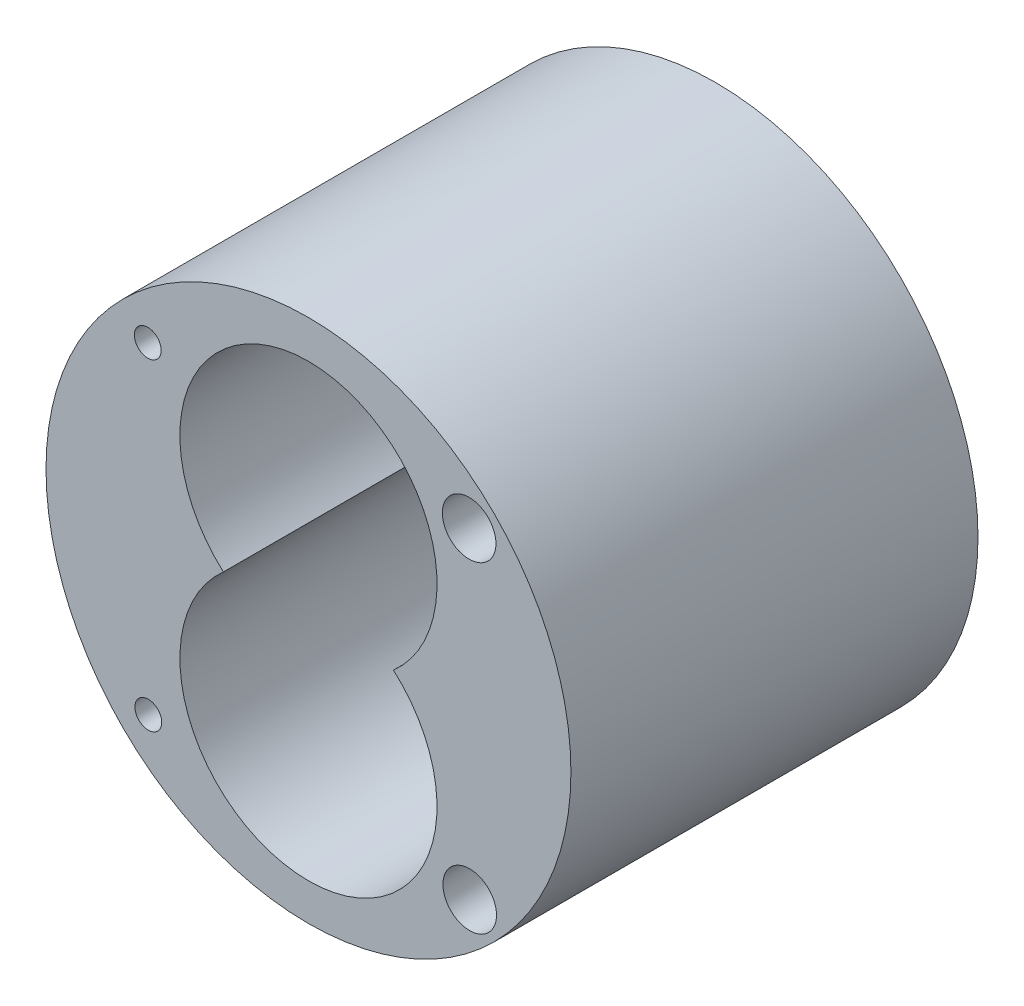
ISO-10303-21;
HEADER;
FILE_DESCRIPTION(('STEP AP214'),'2;1');
FILE_NAME('part.step','',(''),(''),'','','');
FILE_SCHEMA(('AUTOMOTIVE_DESIGN { 1 0 10303 214 1 1 1 1 }'));
ENDSEC;
DATA;
#1=APPLICATION_CONTEXT('core data for automotive mechanical design processes');
#2=APPLICATION_PROTOCOL_DEFINITION('international standard','automotive_design',2000,#1);
#3=PRODUCT_CONTEXT('',#1,'mechanical');
#4=PRODUCT('Part','Part','',(#3));
#5=PRODUCT_RELATED_PRODUCT_CATEGORY('part','',(#4));
#6=PRODUCT_DEFINITION_FORMATION('','',#4);
#7=PRODUCT_DEFINITION_CONTEXT('part definition',#1,'design');
#8=PRODUCT_DEFINITION('design','',#6,#7);
#9=PRODUCT_DEFINITION_SHAPE('','',#8);
#10=(LENGTH_UNIT() NAMED_UNIT(*) SI_UNIT(.MILLI.,.METRE.));
#11=(NAMED_UNIT(*) PLANE_ANGLE_UNIT() SI_UNIT($,.RADIAN.));
#12=(NAMED_UNIT(*) SI_UNIT($,.STERADIAN.) SOLID_ANGLE_UNIT());
#13=UNCERTAINTY_MEASURE_WITH_UNIT(LENGTH_MEASURE(1.E-05),#10,'distance_accuracy_value','');
#14=(GEOMETRIC_REPRESENTATION_CONTEXT(3) GLOBAL_UNCERTAINTY_ASSIGNED_CONTEXT((#13)) GLOBAL_UNIT_ASSIGNED_CONTEXT((#10,
#11,#12)) REPRESENTATION_CONTEXT('',''));
#15=CARTESIAN_POINT('',(0.,0.,0.));
#16=DIRECTION('',(0.,0.,1.));
#17=DIRECTION('',(1.,0.,0.));
#18=AXIS2_PLACEMENT_3D('',#15,#16,#17);
#19=CARTESIAN_POINT('',(0.,17.9150972248558,76.));
#20=DIRECTION('',(0.,0.,-1.));
#21=DIRECTION('',(-1.,0.,0.));
#22=AXIS2_PLACEMENT_3D('',#19,#20,#21);
#23=CYLINDRICAL_SURFACE('',#22,24.);
#24=CARTESIAN_POINT('',(0.,17.9150972248558,0.));
#25=DIRECTION('',(0.,0.,1.));
#26=DIRECTION('',(1.,0.,0.));
#27=AXIS2_PLACEMENT_3D('',#24,#25,#26);
#28=CIRCLE('',#27,24.);
#29=CARTESIAN_POINT('',(15.8745078663875,-0.0849027751442209,0.));
#30=VERTEX_POINT('',#29);
#31=CARTESIAN_POINT('',(-15.8745078663875,-0.0849027751442279,0.));
#32=VERTEX_POINT('',#31);
#33=EDGE_CURVE('E57',#30,#32,#28,.T.);
#34=ORIENTED_EDGE('',*,*,#33,.F.);
#35=DIRECTION('',(0.,0.,-1.));
#36=VECTOR('',#35,1.);
#37=CARTESIAN_POINT('',(15.8745078663875,-0.0849027751442209,76.));
#38=LINE('',#37,#36);
#39=CARTESIAN_POINT('',(15.8745078663875,-0.0849027751442209,76.));
#40=VERTEX_POINT('',#39);
#41=EDGE_CURVE('E11',#40,#30,#38,.T.);
#42=ORIENTED_EDGE('',*,*,#41,.F.);
#43=CARTESIAN_POINT('',(0.,17.9150972248558,76.));
#44=DIRECTION('',(0.,0.,1.));
#45=DIRECTION('',(1.,0.,0.));
#46=AXIS2_PLACEMENT_3D('',#43,#44,#45);
#47=CIRCLE('',#46,24.);
#48=CARTESIAN_POINT('',(-15.8745078663875,-0.0849027751442279,76.));
#49=VERTEX_POINT('',#48);
#50=EDGE_CURVE('E60',#40,#49,#47,.T.);
#51=ORIENTED_EDGE('',*,*,#50,.T.);
#52=DIRECTION('',(0.,0.,-1.));
#53=VECTOR('',#52,1.);
#54=CARTESIAN_POINT('',(-15.8745078663875,-0.0849027751442279,76.));
#55=LINE('',#54,#53);
#56=EDGE_CURVE('E42',#49,#32,#55,.T.);
#57=ORIENTED_EDGE('',*,*,#56,.T.);
#58=EDGE_LOOP('',(#34,#42,#51,#57));
#59=FACE_BOUND('',#58,.T.);
#60=ADVANCED_FACE('F33',(#59),#23,.F.);
#61=CARTESIAN_POINT('',(30.,29.9150972248558,76.));
#62=DIRECTION('',(0.,0.,-1.));
#63=DIRECTION('',(-1.,0.,0.));
#64=AXIS2_PLACEMENT_3D('',#61,#62,#63);
#65=CYLINDRICAL_SURFACE('',#64,5.);
#66=CARTESIAN_POINT('',(30.,29.9150972248558,76.));
#67=DIRECTION('',(0.,0.,1.));
#68=DIRECTION('',(1.,0.,0.));
#69=AXIS2_PLACEMENT_3D('',#66,#67,#68);
#70=CIRCLE('',#69,5.);
#71=CARTESIAN_POINT('',(35.,29.9150972248558,76.));
#72=VERTEX_POINT('',#71);
#73=EDGE_CURVE('E101',#72,#72,#70,.T.);
#74=ORIENTED_EDGE('',*,*,#73,.T.);
#75=EDGE_LOOP('',(#74));
#76=FACE_BOUND('',#75,.T.);
#77=CARTESIAN_POINT('',(30.,29.9150972248558,0.));
#78=DIRECTION('',(0.,0.,1.));
#79=DIRECTION('',(1.,0.,0.));
#80=AXIS2_PLACEMENT_3D('',#77,#78,#79);
#81=CIRCLE('',#80,5.);
#82=CARTESIAN_POINT('',(35.,29.9150972248558,0.));
#83=VERTEX_POINT('',#82);
#84=EDGE_CURVE('E79',#83,#83,#81,.T.);
#85=ORIENTED_EDGE('',*,*,#84,.F.);
#86=EDGE_LOOP('',(#85));
#87=FACE_BOUND('',#86,.T.);
#88=ADVANCED_FACE('F119',(#76,#87),#65,.F.);
#89=CARTESIAN_POINT('',(-29.8985521399415,-30.1800754196668,76.));
#90=DIRECTION('',(0.,0.,-1.));
#91=DIRECTION('',(-1.,0.,0.));
#92=AXIS2_PLACEMENT_3D('',#89,#90,#91);
#93=CYLINDRICAL_SURFACE('',#92,2.50000000000001);
#94=CARTESIAN_POINT('',(-29.8985521399415,-30.1800754196668,76.));
#95=DIRECTION('',(0.,0.,1.));
#96=DIRECTION('',(1.,0.,0.));
#97=AXIS2_PLACEMENT_3D('',#94,#95,#96);
#98=CIRCLE('',#97,2.50000000000001);
#99=CARTESIAN_POINT('',(-27.3985521399415,-30.1800754196668,76.));
#100=VERTEX_POINT('',#99);
#101=EDGE_CURVE('E98',#100,#100,#98,.T.);
#102=ORIENTED_EDGE('',*,*,#101,.T.);
#103=EDGE_LOOP('',(#102));
#104=FACE_BOUND('',#103,.T.);
#105=CARTESIAN_POINT('',(-29.8985521399415,-30.1800754196668,0.));
#106=DIRECTION('',(0.,0.,1.));
#107=DIRECTION('',(1.,0.,0.));
#108=AXIS2_PLACEMENT_3D('',#105,#106,#107);
#109=CIRCLE('',#108,2.50000000000001);
#110=CARTESIAN_POINT('',(-27.3985521399415,-30.1800754196668,0.));
#111=VERTEX_POINT('',#110);
#112=EDGE_CURVE('E73',#111,#111,#109,.T.);
#113=ORIENTED_EDGE('',*,*,#112,.F.);
#114=EDGE_LOOP('',(#113));
#115=FACE_BOUND('',#114,.T.);
#116=ADVANCED_FACE('F123',(#104,#115),#93,.F.);
#117=CARTESIAN_POINT('',(30.1014478600585,-30.0897189802697,76.));
#118=DIRECTION('',(0.,0.,-1.));
#119=DIRECTION('',(-1.,0.,0.));
#120=AXIS2_PLACEMENT_3D('',#117,#118,#119);
#121=CYLINDRICAL_SURFACE('',#120,5.);
#122=CARTESIAN_POINT('',(30.1014478600585,-30.0897189802697,76.));
#123=DIRECTION('',(0.,0.,1.));
#124=DIRECTION('',(1.,0.,0.));
#125=AXIS2_PLACEMENT_3D('',#122,#123,#124);
#126=CIRCLE('',#125,5.);
#127=CARTESIAN_POINT('',(35.1014478600585,-30.0897189802697,76.));
#128=VERTEX_POINT('',#127);
#129=EDGE_CURVE('E95',#128,#128,#126,.T.);
#130=ORIENTED_EDGE('',*,*,#129,.T.);
#131=EDGE_LOOP('',(#130));
#132=FACE_BOUND('',#131,.T.);
#133=CARTESIAN_POINT('',(30.1014478600585,-30.0897189802697,0.));
#134=DIRECTION('',(0.,0.,1.));
#135=DIRECTION('',(1.,0.,0.));
#136=AXIS2_PLACEMENT_3D('',#133,#134,#135);
#137=CIRCLE('',#136,5.);
#138=CARTESIAN_POINT('',(35.1014478600585,-30.0897189802697,0.));
#139=VERTEX_POINT('',#138);
#140=EDGE_CURVE('E70',#139,#139,#137,.T.);
#141=ORIENTED_EDGE('',*,*,#140,.F.);
#142=EDGE_LOOP('',(#141));
#143=FACE_BOUND('',#142,.T.);
#144=ADVANCED_FACE('F129',(#132,#143),#121,.F.);
#145=CARTESIAN_POINT('',(0.,-18.0849027751442,76.));
#146=DIRECTION('',(0.,0.,-1.));
#147=DIRECTION('',(-1.,0.,0.));
#148=AXIS2_PLACEMENT_3D('',#145,#146,#147);
#149=CYLINDRICAL_SURFACE('',#148,24.);
#150=CARTESIAN_POINT('',(0.,-18.0849027751442,0.));
#151=DIRECTION('',(0.,0.,1.));
#152=DIRECTION('',(1.,0.,0.));
#153=AXIS2_PLACEMENT_3D('',#150,#151,#152);
#154=CIRCLE('',#153,24.);
#155=EDGE_CURVE('E66',#32,#30,#154,.T.);
#156=ORIENTED_EDGE('',*,*,#155,.F.);
#157=ORIENTED_EDGE('',*,*,#56,.F.);
#158=CARTESIAN_POINT('',(0.,-18.0849027751442,76.));
#159=DIRECTION('',(0.,0.,1.));
#160=DIRECTION('',(1.,0.,0.));
#161=AXIS2_PLACEMENT_3D('',#158,#159,#160);
#162=CIRCLE('',#161,24.);
#163=EDGE_CURVE('E91',#49,#40,#162,.T.);
#164=ORIENTED_EDGE('',*,*,#163,.T.);
#165=ORIENTED_EDGE('',*,*,#41,.T.);
#166=EDGE_LOOP('',(#156,#157,#164,#165));
#167=FACE_BOUND('',#166,.T.);
#168=ADVANCED_FACE('F69',(#167),#149,.F.);
#169=CARTESIAN_POINT('',(0.,0.,76.));
#170=DIRECTION('',(0.,0.,-1.));
#171=DIRECTION('',(-1.,0.,0.));
#172=AXIS2_PLACEMENT_3D('',#169,#170,#171);
#173=CYLINDRICAL_SURFACE('',#172,49.);
#174=CARTESIAN_POINT('',(0.,0.,76.));
#175=DIRECTION('',(0.,0.,1.));
#176=DIRECTION('',(1.,0.,0.));
#177=AXIS2_PLACEMENT_3D('',#174,#175,#176);
#178=CIRCLE('',#177,49.);
#179=CARTESIAN_POINT('',(49.,0.,76.));
#180=VERTEX_POINT('',#179);
#181=EDGE_CURVE('E84',#180,#180,#178,.T.);
#182=ORIENTED_EDGE('',*,*,#181,.F.);
#183=EDGE_LOOP('',(#182));
#184=FACE_BOUND('',#183,.T.);
#185=CARTESIAN_POINT('',(0.,0.,0.));
#186=DIRECTION('',(0.,0.,1.));
#187=DIRECTION('',(1.,0.,0.));
#188=AXIS2_PLACEMENT_3D('',#185,#186,#187);
#189=CIRCLE('',#188,49.);
#190=CARTESIAN_POINT('',(49.,0.,0.));
#191=VERTEX_POINT('',#190);
#192=EDGE_CURVE('E67',#191,#191,#189,.T.);
#193=ORIENTED_EDGE('',*,*,#192,.T.);
#194=EDGE_LOOP('',(#193));
#195=FACE_BOUND('',#194,.T.);
#196=ADVANCED_FACE('F35',(#184,#195),#173,.T.);
#197=CARTESIAN_POINT('',(-30.,29.9150972248558,76.));
#198=DIRECTION('',(0.,0.,-1.));
#199=DIRECTION('',(-1.,0.,0.));
#200=AXIS2_PLACEMENT_3D('',#197,#198,#199);
#201=CYLINDRICAL_SURFACE('',#200,2.5);
#202=CARTESIAN_POINT('',(-30.,29.9150972248558,76.));
#203=DIRECTION('',(0.,0.,1.));
#204=DIRECTION('',(1.,0.,0.));
#205=AXIS2_PLACEMENT_3D('',#202,#203,#204);
#206=CIRCLE('',#205,2.5);
#207=CARTESIAN_POINT('',(-27.5,29.9150972248558,76.));
#208=VERTEX_POINT('',#207);
#209=EDGE_CURVE('E62',#208,#208,#206,.T.);
#210=ORIENTED_EDGE('',*,*,#209,.T.);
#211=EDGE_LOOP('',(#210));
#212=FACE_BOUND('',#211,.T.);
#213=CARTESIAN_POINT('',(-30.,29.9150972248558,0.));
#214=DIRECTION('',(0.,0.,1.));
#215=DIRECTION('',(1.,0.,0.));
#216=AXIS2_PLACEMENT_3D('',#213,#214,#215);
#217=CIRCLE('',#216,2.5);
#218=CARTESIAN_POINT('',(-27.5,29.9150972248558,0.));
#219=VERTEX_POINT('',#218);
#220=EDGE_CURVE('E82',#219,#219,#217,.T.);
#221=ORIENTED_EDGE('',*,*,#220,.F.);
#222=EDGE_LOOP('',(#221));
#223=FACE_BOUND('',#222,.T.);
#224=ADVANCED_FACE('F115',(#212,#223),#201,.F.);
#225=CARTESIAN_POINT('',(0.,0.,76.));
#226=DIRECTION('',(0.,0.,1.));
#227=DIRECTION('',(1.,0.,0.));
#228=AXIS2_PLACEMENT_3D('',#225,#226,#227);
#229=PLANE('',#228);
#230=ORIENTED_EDGE('',*,*,#181,.T.);
#231=EDGE_LOOP('',(#230));
#232=FACE_BOUND('',#231,.T.);
#233=ORIENTED_EDGE('',*,*,#50,.F.);
#234=ORIENTED_EDGE('',*,*,#163,.F.);
#235=EDGE_LOOP('',(#233,#234));
#236=FACE_BOUND('',#235,.T.);
#237=ORIENTED_EDGE('',*,*,#129,.F.);
#238=EDGE_LOOP('',(#237));
#239=FACE_BOUND('',#238,.T.);
#240=ORIENTED_EDGE('',*,*,#101,.F.);
#241=EDGE_LOOP('',(#240));
#242=FACE_BOUND('',#241,.T.);
#243=ORIENTED_EDGE('',*,*,#73,.F.);
#244=EDGE_LOOP('',(#243));
#245=FACE_BOUND('',#244,.T.);
#246=ORIENTED_EDGE('',*,*,#209,.F.);
#247=EDGE_LOOP('',(#246));
#248=FACE_BOUND('',#247,.T.);
#249=ADVANCED_FACE('F110',(#232,#236,#239,#242,#245,#248),#229,.T.);
#250=CARTESIAN_POINT('',(0.,0.,0.));
#251=DIRECTION('',(0.,0.,1.));
#252=DIRECTION('',(1.,0.,0.));
#253=AXIS2_PLACEMENT_3D('',#250,#251,#252);
#254=PLANE('',#253);
#255=ORIENTED_EDGE('',*,*,#192,.F.);
#256=EDGE_LOOP('',(#255));
#257=FACE_BOUND('',#256,.T.);
#258=ORIENTED_EDGE('',*,*,#33,.T.);
#259=ORIENTED_EDGE('',*,*,#155,.T.);
#260=EDGE_LOOP('',(#258,#259));
#261=FACE_BOUND('',#260,.T.);
#262=ORIENTED_EDGE('',*,*,#140,.T.);
#263=EDGE_LOOP('',(#262));
#264=FACE_BOUND('',#263,.T.);
#265=ORIENTED_EDGE('',*,*,#112,.T.);
#266=EDGE_LOOP('',(#265));
#267=FACE_BOUND('',#266,.T.);
#268=ORIENTED_EDGE('',*,*,#84,.T.);
#269=EDGE_LOOP('',(#268));
#270=FACE_BOUND('',#269,.T.);
#271=ORIENTED_EDGE('',*,*,#220,.T.);
#272=EDGE_LOOP('',(#271));
#273=FACE_BOUND('',#272,.T.);
#274=ADVANCED_FACE('F64',(#257,#261,#264,#267,#270,#273),#254,.F.);
#275=CLOSED_SHELL('',(#60,#88,#116,#144,#168,#196,#224,#249,#274));
#276=MANIFOLD_SOLID_BREP('B2',#275);
#277=ADVANCED_BREP_SHAPE_REPRESENTATION('',(#18,#276),#14);
#278=SHAPE_DEFINITION_REPRESENTATION(#9,#277);
ENDSEC;
END-ISO-10303-21;
